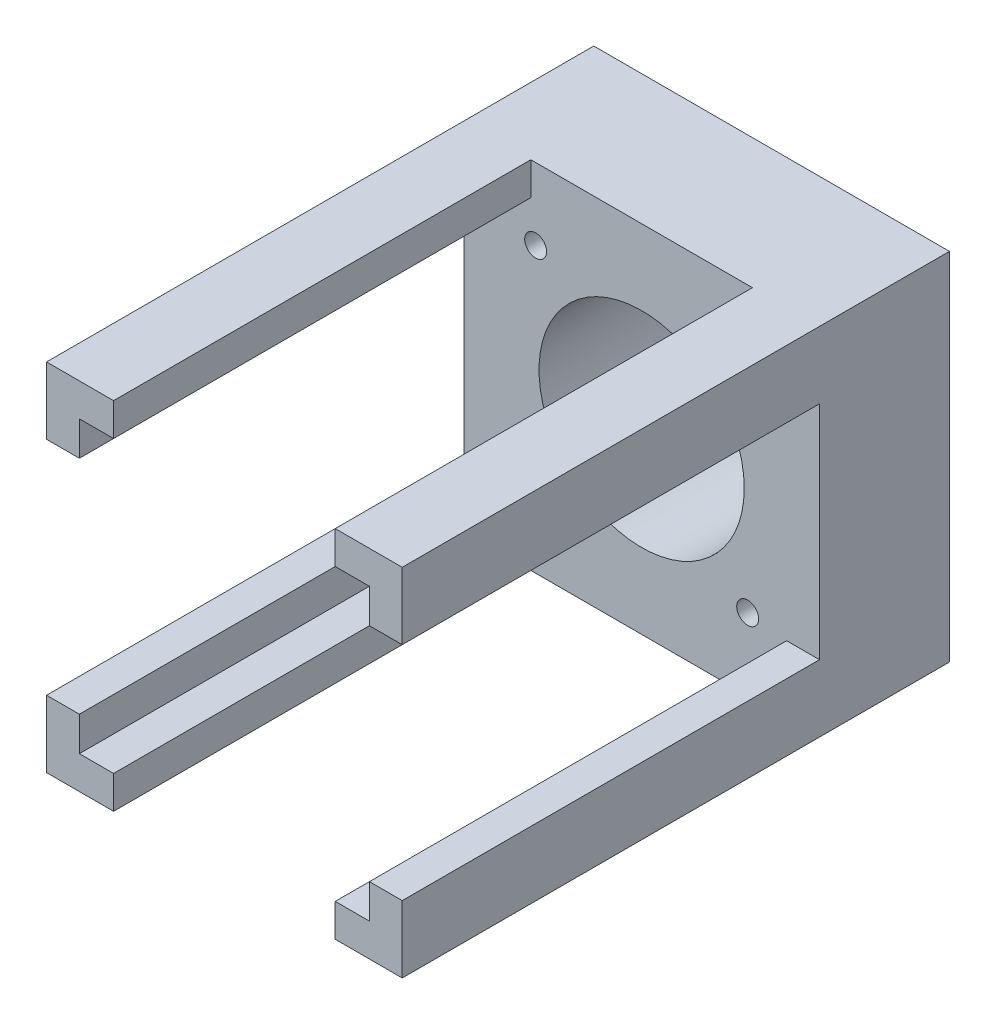
ISO-10303-21;
HEADER;
FILE_DESCRIPTION(('STEP AP214'),'2;1');
FILE_NAME('part.step','',(''),(''),'','','');
FILE_SCHEMA(('AUTOMOTIVE_DESIGN { 1 0 10303 214 1 1 1 1 }'));
ENDSEC;
DATA;
#1=APPLICATION_CONTEXT('core data for automotive mechanical design processes');
#2=APPLICATION_PROTOCOL_DEFINITION('international standard','automotive_design',2000,#1);
#3=PRODUCT_CONTEXT('',#1,'mechanical');
#4=PRODUCT('Part','Part','',(#3));
#5=PRODUCT_RELATED_PRODUCT_CATEGORY('part','',(#4));
#6=PRODUCT_DEFINITION_FORMATION('','',#4);
#7=PRODUCT_DEFINITION_CONTEXT('part definition',#1,'design');
#8=PRODUCT_DEFINITION('design','',#6,#7);
#9=PRODUCT_DEFINITION_SHAPE('','',#8);
#10=(LENGTH_UNIT() NAMED_UNIT(*) SI_UNIT(.MILLI.,.METRE.));
#11=(NAMED_UNIT(*) PLANE_ANGLE_UNIT() SI_UNIT($,.RADIAN.));
#12=(NAMED_UNIT(*) SI_UNIT($,.STERADIAN.) SOLID_ANGLE_UNIT());
#13=UNCERTAINTY_MEASURE_WITH_UNIT(LENGTH_MEASURE(1.E-05),#10,'distance_accuracy_value','');
#14=(GEOMETRIC_REPRESENTATION_CONTEXT(3) GLOBAL_UNCERTAINTY_ASSIGNED_CONTEXT((#13)) GLOBAL_UNIT_ASSIGNED_CONTEXT((#10,
#11,#12)) REPRESENTATION_CONTEXT('',''));
#15=CARTESIAN_POINT('',(0.,0.,0.));
#16=DIRECTION('',(0.,0.,1.));
#17=DIRECTION('',(1.,0.,0.));
#18=AXIS2_PLACEMENT_3D('',#15,#16,#17);
#19=CARTESIAN_POINT('',(0.,0.,80.));
#20=DIRECTION('',(0.,0.,-1.));
#21=DIRECTION('',(-1.,0.,0.));
#22=AXIS2_PLACEMENT_3D('',#19,#20,#21);
#23=PLANE('',#22);
#24=DIRECTION('',(0.,1.,0.));
#25=VECTOR('',#24,1.);
#26=CARTESIAN_POINT('',(3.65443037974685,0.,80.));
#27=LINE('',#26,#25);
#28=CARTESIAN_POINT('',(3.65443037974685,-32.6613924050633,80.));
#29=VERTEX_POINT('',#28);
#30=CARTESIAN_POINT('',(3.65443037974685,-27.8613924050633,80.));
#31=VERTEX_POINT('',#30);
#32=EDGE_CURVE('E338',#29,#31,#27,.T.);
#33=ORIENTED_EDGE('',*,*,#32,.T.);
#34=DIRECTION('',(1.,0.,0.));
#35=VECTOR('',#34,1.);
#36=CARTESIAN_POINT('',(0.,-27.8613924050633,80.));
#37=LINE('',#36,#35);
#38=CARTESIAN_POINT('',(-1.34556962025314,-27.8613924050633,80.));
#39=VERTEX_POINT('',#38);
#40=EDGE_CURVE('E335',#39,#31,#37,.T.);
#41=ORIENTED_EDGE('',*,*,#40,.F.);
#42=DIRECTION('',(0.,-1.,0.));
#43=VECTOR('',#42,1.);
#44=CARTESIAN_POINT('',(-1.34556962025311,0.,80.));
#45=LINE('',#44,#43);
#46=CARTESIAN_POINT('',(-1.34556962025314,-22.8613924050633,80.));
#47=VERTEX_POINT('',#46);
#48=EDGE_CURVE('E332',#47,#39,#45,.T.);
#49=ORIENTED_EDGE('',*,*,#48,.F.);
#50=DIRECTION('',(1.,0.,0.));
#51=VECTOR('',#50,1.);
#52=CARTESIAN_POINT('',(0.,-22.8613924050633,80.));
#53=LINE('',#52,#51);
#54=CARTESIAN_POINT('',(-6.14556962025314,-22.8613924050633,80.));
#55=VERTEX_POINT('',#54);
#56=EDGE_CURVE('E329',#55,#47,#53,.T.);
#57=ORIENTED_EDGE('',*,*,#56,.F.);
#58=DIRECTION('',(0.,-1.,0.));
#59=VECTOR('',#58,1.);
#60=CARTESIAN_POINT('',(-6.14556962025314,19.3386075949367,80.));
#61=LINE('',#60,#59);
#62=CARTESIAN_POINT('',(-6.14556962025314,-32.6613924050633,80.));
#63=VERTEX_POINT('',#62);
#64=EDGE_CURVE('E401',#55,#63,#61,.T.);
#65=ORIENTED_EDGE('',*,*,#64,.T.);
#66=DIRECTION('',(1.,0.,0.));
#67=VECTOR('',#66,1.);
#68=CARTESIAN_POINT('',(-6.14556962025314,-32.6613924050633,80.));
#69=LINE('',#68,#67);
#70=EDGE_CURVE('E405',#63,#29,#69,.T.);
#71=ORIENTED_EDGE('',*,*,#70,.T.);
#72=EDGE_LOOP('',(#33,#41,#49,#57,#65,#71));
#73=FACE_BOUND('',#72,.T.);
#74=ADVANCED_FACE('F42',(#73),#23,.F.);
#75=DIRECTION('',(1.,0.,0.));
#76=VECTOR('',#75,1.);
#77=CARTESIAN_POINT('',(0.,9.53860759493671,80.));
#78=LINE('',#77,#76);
#79=CARTESIAN_POINT('',(-6.14556962025314,9.53860759493671,80.));
#80=VERTEX_POINT('',#79);
#81=CARTESIAN_POINT('',(-1.34556962025314,9.53860759493671,80.));
#82=VERTEX_POINT('',#81);
#83=EDGE_CURVE('E326',#80,#82,#78,.T.);
#84=ORIENTED_EDGE('',*,*,#83,.T.);
#85=DIRECTION('',(0.,-1.,0.));
#86=VECTOR('',#85,1.);
#87=CARTESIAN_POINT('',(-1.34556962025314,0.,80.));
#88=LINE('',#87,#86);
#89=CARTESIAN_POINT('',(-1.34556962025314,14.5386075949367,80.));
#90=VERTEX_POINT('',#89);
#91=EDGE_CURVE('E323',#90,#82,#88,.T.);
#92=ORIENTED_EDGE('',*,*,#91,.F.);
#93=DIRECTION('',(1.,0.,0.));
#94=VECTOR('',#93,1.);
#95=CARTESIAN_POINT('',(0.,14.5386075949367,80.));
#96=LINE('',#95,#94);
#97=CARTESIAN_POINT('',(3.65443037974686,14.5386075949367,80.));
#98=VERTEX_POINT('',#97);
#99=EDGE_CURVE('E320',#90,#98,#96,.T.);
#100=ORIENTED_EDGE('',*,*,#99,.T.);
#101=DIRECTION('',(0.,-1.,0.));
#102=VECTOR('',#101,1.);
#103=CARTESIAN_POINT('',(3.65443037974686,0.,80.));
#104=LINE('',#103,#102);
#105=CARTESIAN_POINT('',(3.65443037974686,19.3386075949367,80.));
#106=VERTEX_POINT('',#105);
#107=EDGE_CURVE('E317',#106,#98,#104,.T.);
#108=ORIENTED_EDGE('',*,*,#107,.F.);
#109=DIRECTION('',(-1.,0.,0.));
#110=VECTOR('',#109,1.);
#111=CARTESIAN_POINT('',(-6.14556962025314,19.3386075949367,80.));
#112=LINE('',#111,#110);
#113=CARTESIAN_POINT('',(-6.14556962025314,19.3386075949367,80.));
#114=VERTEX_POINT('',#113);
#115=EDGE_CURVE('E96',#106,#114,#112,.T.);
#116=ORIENTED_EDGE('',*,*,#115,.T.);
#117=EDGE_CURVE('E402',#114,#80,#61,.T.);
#118=ORIENTED_EDGE('',*,*,#117,.T.);
#119=EDGE_LOOP('',(#84,#92,#100,#108,#116,#118));
#120=FACE_BOUND('',#119,.T.);
#121=ADVANCED_FACE('F512',(#120),#23,.F.);
#122=DIRECTION('',(0.,-1.,0.));
#123=VECTOR('',#122,1.);
#124=CARTESIAN_POINT('',(36.0544303797468,0.,80.));
#125=LINE('',#124,#123);
#126=CARTESIAN_POINT('',(36.0544303797468,19.3386075949367,80.));
#127=VERTEX_POINT('',#126);
#128=CARTESIAN_POINT('',(36.0544303797468,14.5386075949367,80.));
#129=VERTEX_POINT('',#128);
#130=EDGE_CURVE('E314',#127,#129,#125,.T.);
#131=ORIENTED_EDGE('',*,*,#130,.T.);
#132=DIRECTION('',(1.,0.,0.));
#133=VECTOR('',#132,1.);
#134=CARTESIAN_POINT('',(0.,14.5386075949367,80.));
#135=LINE('',#134,#133);
#136=CARTESIAN_POINT('',(41.0544303797469,14.5386075949367,80.));
#137=VERTEX_POINT('',#136);
#138=EDGE_CURVE('E311',#129,#137,#135,.T.);
#139=ORIENTED_EDGE('',*,*,#138,.T.);
#140=DIRECTION('',(0.,-1.,0.));
#141=VECTOR('',#140,1.);
#142=CARTESIAN_POINT('',(41.0544303797468,-1.70923402014245E-13,80.));
#143=LINE('',#142,#141);
#144=CARTESIAN_POINT('',(41.0544303797468,9.53860759493671,80.));
#145=VERTEX_POINT('',#144);
#146=EDGE_CURVE('E308',#137,#145,#143,.T.);
#147=ORIENTED_EDGE('',*,*,#146,.T.);
#148=DIRECTION('',(-1.,0.,0.));
#149=VECTOR('',#148,1.);
#150=CARTESIAN_POINT('',(0.,9.53860759493671,80.));
#151=LINE('',#150,#149);
#152=CARTESIAN_POINT('',(45.8544303797469,9.53860759493671,80.));
#153=VERTEX_POINT('',#152);
#154=EDGE_CURVE('E305',#153,#145,#151,.T.);
#155=ORIENTED_EDGE('',*,*,#154,.F.);
#156=DIRECTION('',(0.,1.,0.));
#157=VECTOR('',#156,1.);
#158=CARTESIAN_POINT('',(45.8544303797469,19.3386075949367,80.));
#159=LINE('',#158,#157);
#160=CARTESIAN_POINT('',(45.8544303797469,19.3386075949367,80.));
#161=VERTEX_POINT('',#160);
#162=EDGE_CURVE('E66',#153,#161,#159,.T.);
#163=ORIENTED_EDGE('',*,*,#162,.T.);
#164=EDGE_CURVE('E399',#161,#127,#112,.T.);
#165=ORIENTED_EDGE('',*,*,#164,.T.);
#166=EDGE_LOOP('',(#131,#139,#147,#155,#163,#165));
#167=FACE_BOUND('',#166,.T.);
#168=ADVANCED_FACE('F443',(#167),#23,.F.);
#169=CARTESIAN_POINT('',(19.8544303797469,-6.66139240506329,80.));
#170=DIRECTION('',(0.,0.,-1.));
#171=DIRECTION('',(-1.,0.,0.));
#172=AXIS2_PLACEMENT_3D('',#169,#170,#171);
#173=CYLINDRICAL_SURFACE('',#172,15.);
#174=CARTESIAN_POINT('',(19.8544303797469,-6.66139240506329,0.));
#175=DIRECTION('',(0.,0.,1.));
#176=DIRECTION('',(1.,0.,0.));
#177=AXIS2_PLACEMENT_3D('',#174,#175,#176);
#178=CIRCLE('',#177,15.);
#179=CARTESIAN_POINT('',(34.8544303797469,-6.66139240506329,0.));
#180=VERTEX_POINT('',#179);
#181=EDGE_CURVE('E395',#180,#180,#178,.T.);
#182=ORIENTED_EDGE('',*,*,#181,.F.);
#183=EDGE_LOOP('',(#182));
#184=FACE_BOUND('',#183,.T.);
#185=CARTESIAN_POINT('',(19.8544303797469,-6.66139240506329,19.));
#186=DIRECTION('',(0.,0.,1.));
#187=DIRECTION('',(1.,0.,0.));
#188=AXIS2_PLACEMENT_3D('',#185,#186,#187);
#189=CIRCLE('',#188,15.);
#190=CARTESIAN_POINT('',(34.8544303797469,-6.66139240506329,19.));
#191=VERTEX_POINT('',#190);
#192=EDGE_CURVE('E288',#191,#191,#189,.F.);
#193=ORIENTED_EDGE('',*,*,#192,.F.);
#194=EDGE_LOOP('',(#193));
#195=FACE_BOUND('',#194,.T.);
#196=ADVANCED_FACE('F531',(#184,#195),#173,.F.);
#197=CARTESIAN_POINT('',(35.3544303797469,8.83860759493671,80.));
#198=DIRECTION('',(0.,0.,-1.));
#199=DIRECTION('',(-1.,0.,0.));
#200=AXIS2_PLACEMENT_3D('',#197,#198,#199);
#201=CYLINDRICAL_SURFACE('',#200,1.6);
#202=CARTESIAN_POINT('',(35.3544303797469,8.83860759493671,0.));
#203=DIRECTION('',(0.,0.,1.));
#204=DIRECTION('',(1.,0.,0.));
#205=AXIS2_PLACEMENT_3D('',#202,#203,#204);
#206=CIRCLE('',#205,1.6);
#207=CARTESIAN_POINT('',(36.9544303797469,8.83860759493671,0.));
#208=VERTEX_POINT('',#207);
#209=EDGE_CURVE('E392',#208,#208,#206,.T.);
#210=ORIENTED_EDGE('',*,*,#209,.F.);
#211=EDGE_LOOP('',(#210));
#212=FACE_BOUND('',#211,.T.);
#213=CARTESIAN_POINT('',(35.3544303797469,8.83860759493671,19.));
#214=DIRECTION('',(0.,0.,1.));
#215=DIRECTION('',(1.,0.,0.));
#216=AXIS2_PLACEMENT_3D('',#213,#214,#215);
#217=CIRCLE('',#216,1.6);
#218=CARTESIAN_POINT('',(36.9544303797469,8.83860759493671,19.));
#219=VERTEX_POINT('',#218);
#220=EDGE_CURVE('E231',#219,#219,#217,.F.);
#221=ORIENTED_EDGE('',*,*,#220,.F.);
#222=EDGE_LOOP('',(#221));
#223=FACE_BOUND('',#222,.T.);
#224=ADVANCED_FACE('F535',(#212,#223),#201,.F.);
#225=CARTESIAN_POINT('',(35.3544303797469,-22.1613924050633,80.));
#226=DIRECTION('',(0.,0.,-1.));
#227=DIRECTION('',(-1.,0.,0.));
#228=AXIS2_PLACEMENT_3D('',#225,#226,#227);
#229=CYLINDRICAL_SURFACE('',#228,1.6);
#230=CARTESIAN_POINT('',(35.3544303797469,-22.1613924050633,0.));
#231=DIRECTION('',(0.,0.,1.));
#232=DIRECTION('',(1.,0.,0.));
#233=AXIS2_PLACEMENT_3D('',#230,#231,#232);
#234=CIRCLE('',#233,1.6);
#235=CARTESIAN_POINT('',(36.9544303797469,-22.1613924050633,0.));
#236=VERTEX_POINT('',#235);
#237=EDGE_CURVE('E389',#236,#236,#234,.T.);
#238=ORIENTED_EDGE('',*,*,#237,.F.);
#239=EDGE_LOOP('',(#238));
#240=FACE_BOUND('',#239,.T.);
#241=CARTESIAN_POINT('',(35.3544303797469,-22.1613924050633,19.));
#242=DIRECTION('',(0.,0.,1.));
#243=DIRECTION('',(1.,0.,0.));
#244=AXIS2_PLACEMENT_3D('',#241,#242,#243);
#245=CIRCLE('',#244,1.6);
#246=CARTESIAN_POINT('',(36.9544303797469,-22.1613924050633,19.));
#247=VERTEX_POINT('',#246);
#248=EDGE_CURVE('E291',#247,#247,#245,.F.);
#249=ORIENTED_EDGE('',*,*,#248,.F.);
#250=EDGE_LOOP('',(#249));
#251=FACE_BOUND('',#250,.T.);
#252=ADVANCED_FACE('F540',(#240,#251),#229,.F.);
#253=CARTESIAN_POINT('',(4.35443037974686,-22.1613924050633,80.));
#254=DIRECTION('',(0.,0.,-1.));
#255=DIRECTION('',(-1.,0.,0.));
#256=AXIS2_PLACEMENT_3D('',#253,#254,#255);
#257=CYLINDRICAL_SURFACE('',#256,1.6);
#258=CARTESIAN_POINT('',(4.35443037974686,-22.1613924050633,0.));
#259=DIRECTION('',(0.,0.,1.));
#260=DIRECTION('',(1.,0.,0.));
#261=AXIS2_PLACEMENT_3D('',#258,#259,#260);
#262=CIRCLE('',#261,1.6);
#263=CARTESIAN_POINT('',(5.95443037974686,-22.1613924050633,0.));
#264=VERTEX_POINT('',#263);
#265=EDGE_CURVE('E386',#264,#264,#262,.T.);
#266=ORIENTED_EDGE('',*,*,#265,.F.);
#267=EDGE_LOOP('',(#266));
#268=FACE_BOUND('',#267,.T.);
#269=CARTESIAN_POINT('',(4.35443037974686,-22.1613924050633,19.));
#270=DIRECTION('',(0.,0.,1.));
#271=DIRECTION('',(1.,0.,0.));
#272=AXIS2_PLACEMENT_3D('',#269,#270,#271);
#273=CIRCLE('',#272,1.6);
#274=CARTESIAN_POINT('',(5.95443037974686,-22.1613924050633,19.));
#275=VERTEX_POINT('',#274);
#276=EDGE_CURVE('E297',#275,#275,#273,.F.);
#277=ORIENTED_EDGE('',*,*,#276,.F.);
#278=EDGE_LOOP('',(#277));
#279=FACE_BOUND('',#278,.T.);
#280=ADVANCED_FACE('F527',(#268,#279),#257,.F.);
#281=CARTESIAN_POINT('',(4.35443037974686,8.83860759493671,80.));
#282=DIRECTION('',(0.,0.,-1.));
#283=DIRECTION('',(-1.,0.,0.));
#284=AXIS2_PLACEMENT_3D('',#281,#282,#283);
#285=CYLINDRICAL_SURFACE('',#284,1.6);
#286=CARTESIAN_POINT('',(4.35443037974686,8.83860759493671,0.));
#287=DIRECTION('',(0.,0.,1.));
#288=DIRECTION('',(1.,0.,0.));
#289=AXIS2_PLACEMENT_3D('',#286,#287,#288);
#290=CIRCLE('',#289,1.6);
#291=CARTESIAN_POINT('',(5.95443037974686,8.83860759493671,0.));
#292=VERTEX_POINT('',#291);
#293=EDGE_CURVE('E345',#292,#292,#290,.T.);
#294=ORIENTED_EDGE('',*,*,#293,.F.);
#295=EDGE_LOOP('',(#294));
#296=FACE_BOUND('',#295,.T.);
#297=CARTESIAN_POINT('',(4.35443037974686,8.83860759493671,19.));
#298=DIRECTION('',(0.,0.,1.));
#299=DIRECTION('',(1.,0.,0.));
#300=AXIS2_PLACEMENT_3D('',#297,#298,#299);
#301=CIRCLE('',#300,1.6);
#302=CARTESIAN_POINT('',(5.95443037974686,8.83860759493671,19.));
#303=VERTEX_POINT('',#302);
#304=EDGE_CURVE('E294',#303,#303,#301,.F.);
#305=ORIENTED_EDGE('',*,*,#304,.F.);
#306=EDGE_LOOP('',(#305));
#307=FACE_BOUND('',#306,.T.);
#308=ADVANCED_FACE('F521',(#296,#307),#285,.F.);
#309=DIRECTION('',(1.,0.,0.));
#310=VECTOR('',#309,1.);
#311=CARTESIAN_POINT('',(0.,-27.8613924050633,80.));
#312=LINE('',#311,#310);
#313=CARTESIAN_POINT('',(36.0544303797468,-27.8613924050633,80.));
#314=VERTEX_POINT('',#313);
#315=CARTESIAN_POINT('',(41.0544303797469,-27.8613924050633,80.));
#316=VERTEX_POINT('',#315);
#317=EDGE_CURVE('E239',#314,#316,#312,.T.);
#318=ORIENTED_EDGE('',*,*,#317,.F.);
#319=DIRECTION('',(0.,1.,0.));
#320=VECTOR('',#319,1.);
#321=CARTESIAN_POINT('',(36.0544303797468,0.,80.));
#322=LINE('',#321,#320);
#323=CARTESIAN_POINT('',(36.0544303797468,-32.6613924050633,80.));
#324=VERTEX_POINT('',#323);
#325=EDGE_CURVE('E242',#324,#314,#322,.T.);
#326=ORIENTED_EDGE('',*,*,#325,.F.);
#327=CARTESIAN_POINT('',(45.8544303797469,-32.6613924050633,80.));
#328=VERTEX_POINT('',#327);
#329=EDGE_CURVE('E404',#324,#328,#69,.T.);
#330=ORIENTED_EDGE('',*,*,#329,.T.);
#331=CARTESIAN_POINT('',(45.8544303797469,-22.8613924050633,80.));
#332=VERTEX_POINT('',#331);
#333=EDGE_CURVE('E408',#328,#332,#159,.T.);
#334=ORIENTED_EDGE('',*,*,#333,.T.);
#335=DIRECTION('',(-1.,0.,0.));
#336=VECTOR('',#335,1.);
#337=CARTESIAN_POINT('',(0.,-22.8613924050633,80.));
#338=LINE('',#337,#336);
#339=CARTESIAN_POINT('',(41.0544303797468,-22.8613924050633,80.));
#340=VERTEX_POINT('',#339);
#341=EDGE_CURVE('E303',#332,#340,#338,.T.);
#342=ORIENTED_EDGE('',*,*,#341,.T.);
#343=DIRECTION('',(0.,-1.,0.));
#344=VECTOR('',#343,1.);
#345=CARTESIAN_POINT('',(41.0544303797467,1.70923402014245E-13,80.));
#346=LINE('',#345,#344);
#347=EDGE_CURVE('E229',#340,#316,#346,.T.);
#348=ORIENTED_EDGE('',*,*,#347,.T.);
#349=EDGE_LOOP('',(#318,#326,#330,#334,#342,#348));
#350=FACE_BOUND('',#349,.T.);
#351=ADVANCED_FACE('F500',(#350),#23,.F.);
#352=CARTESIAN_POINT('',(0.,0.,0.));
#353=DIRECTION('',(0.,0.,-1.));
#354=DIRECTION('',(-1.,0.,0.));
#355=AXIS2_PLACEMENT_3D('',#352,#353,#354);
#356=PLANE('',#355);
#357=ORIENTED_EDGE('',*,*,#265,.T.);
#358=EDGE_LOOP('',(#357));
#359=FACE_BOUND('',#358,.T.);
#360=ORIENTED_EDGE('',*,*,#209,.T.);
#361=EDGE_LOOP('',(#360));
#362=FACE_BOUND('',#361,.T.);
#363=DIRECTION('',(-1.,0.,0.));
#364=VECTOR('',#363,1.);
#365=CARTESIAN_POINT('',(-6.14556962025314,19.3386075949367,0.));
#366=LINE('',#365,#364);
#367=CARTESIAN_POINT('',(45.8544303797469,19.3386075949367,0.));
#368=VERTEX_POINT('',#367);
#369=CARTESIAN_POINT('',(-6.14556962025314,19.3386075949367,0.));
#370=VERTEX_POINT('',#369);
#371=EDGE_CURVE('E398',#368,#370,#366,.T.);
#372=ORIENTED_EDGE('',*,*,#371,.F.);
#373=DIRECTION('',(0.,1.,0.));
#374=VECTOR('',#373,1.);
#375=CARTESIAN_POINT('',(45.8544303797469,19.3386075949367,0.));
#376=LINE('',#375,#374);
#377=CARTESIAN_POINT('',(45.8544303797469,-32.6613924050633,0.));
#378=VERTEX_POINT('',#377);
#379=EDGE_CURVE('E88',#378,#368,#376,.T.);
#380=ORIENTED_EDGE('',*,*,#379,.F.);
#381=DIRECTION('',(1.,0.,0.));
#382=VECTOR('',#381,1.);
#383=CARTESIAN_POINT('',(-6.14556962025314,-32.6613924050633,0.));
#384=LINE('',#383,#382);
#385=CARTESIAN_POINT('',(-6.14556962025314,-32.6613924050633,0.));
#386=VERTEX_POINT('',#385);
#387=EDGE_CURVE('E416',#386,#378,#384,.T.);
#388=ORIENTED_EDGE('',*,*,#387,.F.);
#389=DIRECTION('',(0.,-1.,0.));
#390=VECTOR('',#389,1.);
#391=CARTESIAN_POINT('',(-6.14556962025314,19.3386075949367,0.));
#392=LINE('',#391,#390);
#393=EDGE_CURVE('E414',#370,#386,#392,.T.);
#394=ORIENTED_EDGE('',*,*,#393,.F.);
#395=EDGE_LOOP('',(#372,#380,#388,#394));
#396=FACE_BOUND('',#395,.T.);
#397=ORIENTED_EDGE('',*,*,#181,.T.);
#398=EDGE_LOOP('',(#397));
#399=FACE_BOUND('',#398,.T.);
#400=ORIENTED_EDGE('',*,*,#237,.T.);
#401=EDGE_LOOP('',(#400));
#402=FACE_BOUND('',#401,.T.);
#403=ORIENTED_EDGE('',*,*,#293,.T.);
#404=EDGE_LOOP('',(#403));
#405=FACE_BOUND('',#404,.T.);
#406=ADVANCED_FACE('F433',(#359,#362,#396,#399,#402,#405),#356,.T.);
#407=CARTESIAN_POINT('',(-6.14556962025314,19.3386075949367,80.));
#408=DIRECTION('',(0.,-1.,0.));
#409=DIRECTION('',(0.,0.,-1.));
#410=AXIS2_PLACEMENT_3D('',#407,#408,#409);
#411=PLANE('',#410);
#412=ORIENTED_EDGE('',*,*,#115,.F.);
#413=DIRECTION('',(0.,0.,1.));
#414=VECTOR('',#413,1.);
#415=CARTESIAN_POINT('',(3.65443037974686,19.3386075949367,19.));
#416=LINE('',#415,#414);
#417=CARTESIAN_POINT('',(3.65443037974686,19.3386075949367,19.));
#418=VERTEX_POINT('',#417);
#419=EDGE_CURVE('E370',#418,#106,#416,.T.);
#420=ORIENTED_EDGE('',*,*,#419,.F.);
#421=DIRECTION('',(-1.,0.,0.));
#422=VECTOR('',#421,1.);
#423=CARTESIAN_POINT('',(0.,19.3386075949367,19.));
#424=LINE('',#423,#422);
#425=CARTESIAN_POINT('',(36.0544303797468,19.3386075949367,19.));
#426=VERTEX_POINT('',#425);
#427=EDGE_CURVE('E255',#426,#418,#424,.T.);
#428=ORIENTED_EDGE('',*,*,#427,.F.);
#429=DIRECTION('',(0.,0.,1.));
#430=VECTOR('',#429,1.);
#431=CARTESIAN_POINT('',(36.0544303797468,19.3386075949367,19.));
#432=LINE('',#431,#430);
#433=EDGE_CURVE('E372',#426,#127,#432,.T.);
#434=ORIENTED_EDGE('',*,*,#433,.T.);
#435=ORIENTED_EDGE('',*,*,#164,.F.);
#436=DIRECTION('',(0.,0.,-1.));
#437=VECTOR('',#436,1.);
#438=CARTESIAN_POINT('',(45.8544303797469,19.3386075949367,80.));
#439=LINE('',#438,#437);
#440=EDGE_CURVE('E411',#161,#368,#439,.T.);
#441=ORIENTED_EDGE('',*,*,#440,.T.);
#442=ORIENTED_EDGE('',*,*,#371,.T.);
#443=DIRECTION('',(0.,0.,-1.));
#444=VECTOR('',#443,1.);
#445=CARTESIAN_POINT('',(-6.14556962025314,19.3386075949367,80.));
#446=LINE('',#445,#444);
#447=EDGE_CURVE('E11',#114,#370,#446,.T.);
#448=ORIENTED_EDGE('',*,*,#447,.F.);
#449=EDGE_LOOP('',(#412,#420,#428,#434,#435,#441,#442,#448));
#450=FACE_BOUND('',#449,.T.);
#451=ADVANCED_FACE('F44',(#450),#411,.F.);
#452=CARTESIAN_POINT('',(-6.14556962025314,19.3386075949367,80.));
#453=DIRECTION('',(1.,0.,0.));
#454=DIRECTION('',(0.,0.,-1.));
#455=AXIS2_PLACEMENT_3D('',#452,#453,#454);
#456=PLANE('',#455);
#457=ORIENTED_EDGE('',*,*,#64,.F.);
#458=DIRECTION('',(0.,0.,1.));
#459=VECTOR('',#458,1.);
#460=CARTESIAN_POINT('',(-6.14556962025314,-22.8613924050633,19.));
#461=LINE('',#460,#459);
#462=CARTESIAN_POINT('',(-6.14556962025314,-22.8613924050633,19.));
#463=VERTEX_POINT('',#462);
#464=EDGE_CURVE('E359',#463,#55,#461,.T.);
#465=ORIENTED_EDGE('',*,*,#464,.F.);
#466=DIRECTION('',(0.,-1.,0.));
#467=VECTOR('',#466,1.);
#468=CARTESIAN_POINT('',(-6.14556962025314,0.,19.));
#469=LINE('',#468,#467);
#470=CARTESIAN_POINT('',(-6.14556962025314,9.53860759493671,19.));
#471=VERTEX_POINT('',#470);
#472=EDGE_CURVE('E268',#471,#463,#469,.T.);
#473=ORIENTED_EDGE('',*,*,#472,.F.);
#474=DIRECTION('',(0.,0.,1.));
#475=VECTOR('',#474,1.);
#476=CARTESIAN_POINT('',(-6.14556962025314,9.53860759493671,19.));
#477=LINE('',#476,#475);
#478=EDGE_CURVE('E361',#471,#80,#477,.T.);
#479=ORIENTED_EDGE('',*,*,#478,.T.);
#480=ORIENTED_EDGE('',*,*,#117,.F.);
#481=ORIENTED_EDGE('',*,*,#447,.T.);
#482=ORIENTED_EDGE('',*,*,#393,.T.);
#483=DIRECTION('',(0.,0.,-1.));
#484=VECTOR('',#483,1.);
#485=CARTESIAN_POINT('',(-6.14556962025314,-32.6613924050633,80.));
#486=LINE('',#485,#484);
#487=EDGE_CURVE('E50',#63,#386,#486,.T.);
#488=ORIENTED_EDGE('',*,*,#487,.F.);
#489=EDGE_LOOP('',(#457,#465,#473,#479,#480,#481,#482,#488));
#490=FACE_BOUND('',#489,.T.);
#491=ADVANCED_FACE('F475',(#490),#456,.F.);
#492=CARTESIAN_POINT('',(-6.14556962025314,-32.6613924050633,80.));
#493=DIRECTION('',(0.,1.,0.));
#494=DIRECTION('',(0.,0.,1.));
#495=AXIS2_PLACEMENT_3D('',#492,#493,#494);
#496=PLANE('',#495);
#497=ORIENTED_EDGE('',*,*,#329,.F.);
#498=DIRECTION('',(0.,0.,1.));
#499=VECTOR('',#498,1.);
#500=CARTESIAN_POINT('',(36.0544303797468,-32.6613924050633,19.));
#501=LINE('',#500,#499);
#502=CARTESIAN_POINT('',(36.0544303797468,-32.6613924050633,19.));
#503=VERTEX_POINT('',#502);
#504=EDGE_CURVE('E348',#503,#324,#501,.T.);
#505=ORIENTED_EDGE('',*,*,#504,.F.);
#506=DIRECTION('',(1.,0.,0.));
#507=VECTOR('',#506,1.);
#508=CARTESIAN_POINT('',(0.,-32.6613924050633,19.));
#509=LINE('',#508,#507);
#510=CARTESIAN_POINT('',(3.65443037974685,-32.6613924050633,19.));
#511=VERTEX_POINT('',#510);
#512=EDGE_CURVE('E282',#511,#503,#509,.T.);
#513=ORIENTED_EDGE('',*,*,#512,.F.);
#514=DIRECTION('',(0.,0.,1.));
#515=VECTOR('',#514,1.);
#516=CARTESIAN_POINT('',(3.65443037974685,-32.6613924050633,19.));
#517=LINE('',#516,#515);
#518=EDGE_CURVE('E350',#511,#29,#517,.T.);
#519=ORIENTED_EDGE('',*,*,#518,.T.);
#520=ORIENTED_EDGE('',*,*,#70,.F.);
#521=ORIENTED_EDGE('',*,*,#487,.T.);
#522=ORIENTED_EDGE('',*,*,#387,.T.);
#523=DIRECTION('',(0.,0.,-1.));
#524=VECTOR('',#523,1.);
#525=CARTESIAN_POINT('',(45.8544303797469,-32.6613924050633,80.));
#526=LINE('',#525,#524);
#527=EDGE_CURVE('E420',#328,#378,#526,.T.);
#528=ORIENTED_EDGE('',*,*,#527,.F.);
#529=EDGE_LOOP('',(#497,#505,#513,#519,#520,#521,#522,#528));
#530=FACE_BOUND('',#529,.T.);
#531=ADVANCED_FACE('F427',(#530),#496,.F.);
#532=CARTESIAN_POINT('',(45.8544303797469,19.3386075949367,80.));
#533=DIRECTION('',(-1.,0.,0.));
#534=DIRECTION('',(0.,-1.,0.));
#535=AXIS2_PLACEMENT_3D('',#532,#533,#534);
#536=PLANE('',#535);
#537=ORIENTED_EDGE('',*,*,#162,.F.);
#538=DIRECTION('',(0.,0.,1.));
#539=VECTOR('',#538,1.);
#540=CARTESIAN_POINT('',(45.8544303797469,9.53860759493671,19.));
#541=LINE('',#540,#539);
#542=CARTESIAN_POINT('',(45.8544303797469,9.53860759493671,19.));
#543=VERTEX_POINT('',#542);
#544=EDGE_CURVE('E381',#543,#153,#541,.T.);
#545=ORIENTED_EDGE('',*,*,#544,.F.);
#546=DIRECTION('',(0.,1.,0.));
#547=VECTOR('',#546,1.);
#548=CARTESIAN_POINT('',(45.8544303797469,0.,19.));
#549=LINE('',#548,#547);
#550=CARTESIAN_POINT('',(45.8544303797469,-22.8613924050633,19.));
#551=VERTEX_POINT('',#550);
#552=EDGE_CURVE('E222',#551,#543,#549,.T.);
#553=ORIENTED_EDGE('',*,*,#552,.F.);
#554=DIRECTION('',(0.,0.,1.));
#555=VECTOR('',#554,1.);
#556=CARTESIAN_POINT('',(45.8544303797469,-22.8613924050633,19.));
#557=LINE('',#556,#555);
#558=EDGE_CURVE('E220',#551,#332,#557,.T.);
#559=ORIENTED_EDGE('',*,*,#558,.T.);
#560=ORIENTED_EDGE('',*,*,#333,.F.);
#561=ORIENTED_EDGE('',*,*,#527,.T.);
#562=ORIENTED_EDGE('',*,*,#379,.T.);
#563=ORIENTED_EDGE('',*,*,#440,.F.);
#564=EDGE_LOOP('',(#537,#545,#553,#559,#560,#561,#562,#563));
#565=FACE_BOUND('',#564,.T.);
#566=ADVANCED_FACE('F438',(#565),#536,.F.);
#567=CARTESIAN_POINT('',(41.0544303797467,1.70923402014245E-13,19.));
#568=DIRECTION('',(-1.,0.,0.));
#569=DIRECTION('',(0.,-1.,0.));
#570=AXIS2_PLACEMENT_3D('',#567,#568,#569);
#571=PLANE('',#570);
#572=ORIENTED_EDGE('',*,*,#347,.F.);
#573=DIRECTION('',(0.,0.,1.));
#574=VECTOR('',#573,1.);
#575=CARTESIAN_POINT('',(41.0544303797468,-22.8613924050633,19.));
#576=LINE('',#575,#574);
#577=CARTESIAN_POINT('',(41.0544303797468,-22.8613924050633,19.));
#578=VERTEX_POINT('',#577);
#579=EDGE_CURVE('E217',#578,#340,#576,.T.);
#580=ORIENTED_EDGE('',*,*,#579,.F.);
#581=DIRECTION('',(0.,-1.,0.));
#582=VECTOR('',#581,1.);
#583=CARTESIAN_POINT('',(41.0544303797467,1.70923402014245E-13,19.));
#584=LINE('',#583,#582);
#585=CARTESIAN_POINT('',(41.0544303797469,-27.8613924050633,19.));
#586=VERTEX_POINT('',#585);
#587=EDGE_CURVE('E223',#578,#586,#584,.T.);
#588=ORIENTED_EDGE('',*,*,#587,.T.);
#589=DIRECTION('',(0.,0.,1.));
#590=VECTOR('',#589,1.);
#591=CARTESIAN_POINT('',(41.0544303797469,-27.8613924050633,19.));
#592=LINE('',#591,#590);
#593=EDGE_CURVE('E343',#586,#316,#592,.T.);
#594=ORIENTED_EDGE('',*,*,#593,.T.);
#595=EDGE_LOOP('',(#572,#580,#588,#594));
#596=FACE_BOUND('',#595,.T.);
#597=ADVANCED_FACE('F226',(#596),#571,.T.);
#598=CARTESIAN_POINT('',(0.,-27.8613924050633,19.));
#599=DIRECTION('',(0.,-1.,0.));
#600=DIRECTION('',(0.,0.,-1.));
#601=AXIS2_PLACEMENT_3D('',#598,#599,#600);
#602=PLANE('',#601);
#603=ORIENTED_EDGE('',*,*,#317,.T.);
#604=ORIENTED_EDGE('',*,*,#593,.F.);
#605=DIRECTION('',(1.,0.,0.));
#606=VECTOR('',#605,1.);
#607=CARTESIAN_POINT('',(0.,-27.8613924050633,19.));
#608=LINE('',#607,#606);
#609=CARTESIAN_POINT('',(36.0544303797468,-27.8613924050633,19.));
#610=VERTEX_POINT('',#609);
#611=EDGE_CURVE('E238',#610,#586,#608,.T.);
#612=ORIENTED_EDGE('',*,*,#611,.F.);
#613=DIRECTION('',(0.,0.,1.));
#614=VECTOR('',#613,1.);
#615=CARTESIAN_POINT('',(36.0544303797468,-27.8613924050633,19.));
#616=LINE('',#615,#614);
#617=EDGE_CURVE('E346',#610,#314,#616,.T.);
#618=ORIENTED_EDGE('',*,*,#617,.T.);
#619=EDGE_LOOP('',(#603,#604,#612,#618));
#620=FACE_BOUND('',#619,.T.);
#621=ADVANCED_FACE('F496',(#620),#602,.F.);
#622=CARTESIAN_POINT('',(36.0544303797468,0.,19.));
#623=DIRECTION('',(1.,0.,0.));
#624=DIRECTION('',(0.,0.,-1.));
#625=AXIS2_PLACEMENT_3D('',#622,#623,#624);
#626=PLANE('',#625);
#627=ORIENTED_EDGE('',*,*,#325,.T.);
#628=ORIENTED_EDGE('',*,*,#617,.F.);
#629=DIRECTION('',(0.,1.,0.));
#630=VECTOR('',#629,1.);
#631=CARTESIAN_POINT('',(36.0544303797468,0.,19.));
#632=LINE('',#631,#630);
#633=EDGE_CURVE('E285',#503,#610,#632,.T.);
#634=ORIENTED_EDGE('',*,*,#633,.F.);
#635=ORIENTED_EDGE('',*,*,#504,.T.);
#636=EDGE_LOOP('',(#627,#628,#634,#635));
#637=FACE_BOUND('',#636,.T.);
#638=ADVANCED_FACE('F502',(#637),#626,.F.);
#639=CARTESIAN_POINT('',(3.65443037974685,0.,19.));
#640=DIRECTION('',(1.,0.,0.));
#641=DIRECTION('',(0.,1.,0.));
#642=AXIS2_PLACEMENT_3D('',#639,#640,#641);
#643=PLANE('',#642);
#644=ORIENTED_EDGE('',*,*,#32,.F.);
#645=ORIENTED_EDGE('',*,*,#518,.F.);
#646=DIRECTION('',(0.,1.,0.));
#647=VECTOR('',#646,1.);
#648=CARTESIAN_POINT('',(3.65443037974685,0.,19.));
#649=LINE('',#648,#647);
#650=CARTESIAN_POINT('',(3.65443037974685,-27.8613924050633,19.));
#651=VERTEX_POINT('',#650);
#652=EDGE_CURVE('E280',#511,#651,#649,.T.);
#653=ORIENTED_EDGE('',*,*,#652,.T.);
#654=DIRECTION('',(0.,0.,1.));
#655=VECTOR('',#654,1.);
#656=CARTESIAN_POINT('',(3.65443037974685,-27.8613924050633,19.));
#657=LINE('',#656,#655);
#658=EDGE_CURVE('E353',#651,#31,#657,.T.);
#659=ORIENTED_EDGE('',*,*,#658,.T.);
#660=EDGE_LOOP('',(#644,#645,#653,#659));
#661=FACE_BOUND('',#660,.T.);
#662=ADVANCED_FACE('F492',(#661),#643,.T.);
#663=CARTESIAN_POINT('',(0.,-27.8613924050633,19.));
#664=DIRECTION('',(0.,-1.,0.));
#665=DIRECTION('',(0.,0.,-1.));
#666=AXIS2_PLACEMENT_3D('',#663,#664,#665);
#667=PLANE('',#666);
#668=ORIENTED_EDGE('',*,*,#40,.T.);
#669=ORIENTED_EDGE('',*,*,#658,.F.);
#670=DIRECTION('',(1.,0.,0.));
#671=VECTOR('',#670,1.);
#672=CARTESIAN_POINT('',(0.,-27.8613924050633,19.));
#673=LINE('',#672,#671);
#674=CARTESIAN_POINT('',(-1.34556962025314,-27.8613924050633,19.));
#675=VERTEX_POINT('',#674);
#676=EDGE_CURVE('E277',#675,#651,#673,.T.);
#677=ORIENTED_EDGE('',*,*,#676,.F.);
#678=DIRECTION('',(0.,0.,1.));
#679=VECTOR('',#678,1.);
#680=CARTESIAN_POINT('',(-1.34556962025314,-27.8613924050633,19.));
#681=LINE('',#680,#679);
#682=EDGE_CURVE('E355',#675,#39,#681,.T.);
#683=ORIENTED_EDGE('',*,*,#682,.T.);
#684=EDGE_LOOP('',(#668,#669,#677,#683));
#685=FACE_BOUND('',#684,.T.);
#686=ADVANCED_FACE('F490',(#685),#667,.F.);
#687=CARTESIAN_POINT('',(-1.34556962025311,0.,19.));
#688=DIRECTION('',(-1.,0.,0.));
#689=DIRECTION('',(0.,-1.,0.));
#690=AXIS2_PLACEMENT_3D('',#687,#688,#689);
#691=PLANE('',#690);
#692=ORIENTED_EDGE('',*,*,#48,.T.);
#693=ORIENTED_EDGE('',*,*,#682,.F.);
#694=DIRECTION('',(0.,-1.,0.));
#695=VECTOR('',#694,1.);
#696=CARTESIAN_POINT('',(-1.34556962025311,0.,19.));
#697=LINE('',#696,#695);
#698=CARTESIAN_POINT('',(-1.34556962025314,-22.8613924050633,19.));
#699=VERTEX_POINT('',#698);
#700=EDGE_CURVE('E274',#699,#675,#697,.T.);
#701=ORIENTED_EDGE('',*,*,#700,.F.);
#702=DIRECTION('',(0.,0.,1.));
#703=VECTOR('',#702,1.);
#704=CARTESIAN_POINT('',(-1.34556962025314,-22.8613924050633,19.));
#705=LINE('',#704,#703);
#706=EDGE_CURVE('E357',#699,#47,#705,.T.);
#707=ORIENTED_EDGE('',*,*,#706,.T.);
#708=EDGE_LOOP('',(#692,#693,#701,#707));
#709=FACE_BOUND('',#708,.T.);
#710=ADVANCED_FACE('F483',(#709),#691,.F.);
#711=CARTESIAN_POINT('',(0.,-22.8613924050633,19.));
#712=DIRECTION('',(0.,-1.,0.));
#713=DIRECTION('',(0.,0.,-1.));
#714=AXIS2_PLACEMENT_3D('',#711,#712,#713);
#715=PLANE('',#714);
#716=ORIENTED_EDGE('',*,*,#56,.T.);
#717=ORIENTED_EDGE('',*,*,#706,.F.);
#718=DIRECTION('',(1.,0.,0.));
#719=VECTOR('',#718,1.);
#720=CARTESIAN_POINT('',(0.,-22.8613924050633,19.));
#721=LINE('',#720,#719);
#722=EDGE_CURVE('E271',#463,#699,#721,.T.);
#723=ORIENTED_EDGE('',*,*,#722,.F.);
#724=ORIENTED_EDGE('',*,*,#464,.T.);
#725=EDGE_LOOP('',(#716,#717,#723,#724));
#726=FACE_BOUND('',#725,.T.);
#727=ADVANCED_FACE('F478',(#726),#715,.F.);
#728=CARTESIAN_POINT('',(0.,9.53860759493671,19.));
#729=DIRECTION('',(0.,-1.,0.));
#730=DIRECTION('',(0.,0.,-1.));
#731=AXIS2_PLACEMENT_3D('',#728,#729,#730);
#732=PLANE('',#731);
#733=ORIENTED_EDGE('',*,*,#83,.F.);
#734=ORIENTED_EDGE('',*,*,#478,.F.);
#735=DIRECTION('',(1.,0.,0.));
#736=VECTOR('',#735,1.);
#737=CARTESIAN_POINT('',(0.,9.53860759493671,19.));
#738=LINE('',#737,#736);
#739=CARTESIAN_POINT('',(-1.34556962025314,9.53860759493671,19.));
#740=VERTEX_POINT('',#739);
#741=EDGE_CURVE('E266',#471,#740,#738,.T.);
#742=ORIENTED_EDGE('',*,*,#741,.T.);
#743=DIRECTION('',(0.,0.,1.));
#744=VECTOR('',#743,1.);
#745=CARTESIAN_POINT('',(-1.34556962025314,9.53860759493671,19.));
#746=LINE('',#745,#744);
#747=EDGE_CURVE('E364',#740,#82,#746,.T.);
#748=ORIENTED_EDGE('',*,*,#747,.T.);
#749=EDGE_LOOP('',(#733,#734,#742,#748));
#750=FACE_BOUND('',#749,.T.);
#751=ADVANCED_FACE('F570',(#750),#732,.T.);
#752=CARTESIAN_POINT('',(-1.34556962025314,0.,19.));
#753=DIRECTION('',(-1.,0.,0.));
#754=DIRECTION('',(0.,-1.,0.));
#755=AXIS2_PLACEMENT_3D('',#752,#753,#754);
#756=PLANE('',#755);
#757=ORIENTED_EDGE('',*,*,#91,.T.);
#758=ORIENTED_EDGE('',*,*,#747,.F.);
#759=DIRECTION('',(0.,-1.,0.));
#760=VECTOR('',#759,1.);
#761=CARTESIAN_POINT('',(-1.34556962025314,0.,19.));
#762=LINE('',#761,#760);
#763=CARTESIAN_POINT('',(-1.34556962025314,14.5386075949367,19.));
#764=VERTEX_POINT('',#763);
#765=EDGE_CURVE('E263',#764,#740,#762,.T.);
#766=ORIENTED_EDGE('',*,*,#765,.F.);
#767=DIRECTION('',(0.,0.,1.));
#768=VECTOR('',#767,1.);
#769=CARTESIAN_POINT('',(-1.34556962025314,14.5386075949367,19.));
#770=LINE('',#769,#768);
#771=EDGE_CURVE('E366',#764,#90,#770,.T.);
#772=ORIENTED_EDGE('',*,*,#771,.T.);
#773=EDGE_LOOP('',(#757,#758,#766,#772));
#774=FACE_BOUND('',#773,.T.);
#775=ADVANCED_FACE('F469',(#774),#756,.F.);
#776=CARTESIAN_POINT('',(0.,14.5386075949367,19.));
#777=DIRECTION('',(0.,-1.,0.));
#778=DIRECTION('',(0.,0.,-1.));
#779=AXIS2_PLACEMENT_3D('',#776,#777,#778);
#780=PLANE('',#779);
#781=ORIENTED_EDGE('',*,*,#99,.F.);
#782=ORIENTED_EDGE('',*,*,#771,.F.);
#783=DIRECTION('',(1.,0.,0.));
#784=VECTOR('',#783,1.);
#785=CARTESIAN_POINT('',(0.,14.5386075949367,19.));
#786=LINE('',#785,#784);
#787=CARTESIAN_POINT('',(3.65443037974686,14.5386075949367,19.));
#788=VERTEX_POINT('',#787);
#789=EDGE_CURVE('E261',#764,#788,#786,.T.);
#790=ORIENTED_EDGE('',*,*,#789,.T.);
#791=DIRECTION('',(0.,0.,1.));
#792=VECTOR('',#791,1.);
#793=CARTESIAN_POINT('',(3.65443037974686,14.5386075949367,19.));
#794=LINE('',#793,#792);
#795=EDGE_CURVE('E368',#788,#98,#794,.T.);
#796=ORIENTED_EDGE('',*,*,#795,.T.);
#797=EDGE_LOOP('',(#781,#782,#790,#796));
#798=FACE_BOUND('',#797,.T.);
#799=ADVANCED_FACE('F466',(#798),#780,.T.);
#800=CARTESIAN_POINT('',(3.65443037974686,0.,19.));
#801=DIRECTION('',(-1.,0.,0.));
#802=DIRECTION('',(0.,-1.,0.));
#803=AXIS2_PLACEMENT_3D('',#800,#801,#802);
#804=PLANE('',#803);
#805=ORIENTED_EDGE('',*,*,#107,.T.);
#806=ORIENTED_EDGE('',*,*,#795,.F.);
#807=DIRECTION('',(0.,-1.,0.));
#808=VECTOR('',#807,1.);
#809=CARTESIAN_POINT('',(3.65443037974686,0.,19.));
#810=LINE('',#809,#808);
#811=EDGE_CURVE('E258',#418,#788,#810,.T.);
#812=ORIENTED_EDGE('',*,*,#811,.F.);
#813=ORIENTED_EDGE('',*,*,#419,.T.);
#814=EDGE_LOOP('',(#805,#806,#812,#813));
#815=FACE_BOUND('',#814,.T.);
#816=ADVANCED_FACE('F463',(#815),#804,.F.);
#817=CARTESIAN_POINT('',(36.0544303797468,0.,19.));
#818=DIRECTION('',(-1.,0.,0.));
#819=DIRECTION('',(0.,0.,1.));
#820=AXIS2_PLACEMENT_3D('',#817,#818,#819);
#821=PLANE('',#820);
#822=ORIENTED_EDGE('',*,*,#130,.F.);
#823=ORIENTED_EDGE('',*,*,#433,.F.);
#824=DIRECTION('',(0.,-1.,0.));
#825=VECTOR('',#824,1.);
#826=CARTESIAN_POINT('',(36.0544303797468,0.,19.));
#827=LINE('',#826,#825);
#828=CARTESIAN_POINT('',(36.0544303797468,14.5386075949367,19.));
#829=VERTEX_POINT('',#828);
#830=EDGE_CURVE('E253',#426,#829,#827,.T.);
#831=ORIENTED_EDGE('',*,*,#830,.T.);
#832=DIRECTION('',(0.,0.,1.));
#833=VECTOR('',#832,1.);
#834=CARTESIAN_POINT('',(36.0544303797468,14.5386075949367,19.));
#835=LINE('',#834,#833);
#836=EDGE_CURVE('E375',#829,#129,#835,.T.);
#837=ORIENTED_EDGE('',*,*,#836,.T.);
#838=EDGE_LOOP('',(#822,#823,#831,#837));
#839=FACE_BOUND('',#838,.T.);
#840=ADVANCED_FACE('F457',(#839),#821,.T.);
#841=CARTESIAN_POINT('',(0.,14.5386075949367,19.));
#842=DIRECTION('',(0.,-1.,0.));
#843=DIRECTION('',(0.,0.,-1.));
#844=AXIS2_PLACEMENT_3D('',#841,#842,#843);
#845=PLANE('',#844);
#846=ORIENTED_EDGE('',*,*,#138,.F.);
#847=ORIENTED_EDGE('',*,*,#836,.F.);
#848=DIRECTION('',(1.,0.,0.));
#849=VECTOR('',#848,1.);
#850=CARTESIAN_POINT('',(0.,14.5386075949367,19.));
#851=LINE('',#850,#849);
#852=CARTESIAN_POINT('',(41.0544303797469,14.5386075949367,19.));
#853=VERTEX_POINT('',#852);
#854=EDGE_CURVE('E251',#829,#853,#851,.T.);
#855=ORIENTED_EDGE('',*,*,#854,.T.);
#856=DIRECTION('',(0.,0.,1.));
#857=VECTOR('',#856,1.);
#858=CARTESIAN_POINT('',(41.0544303797469,14.5386075949367,19.));
#859=LINE('',#858,#857);
#860=EDGE_CURVE('E377',#853,#137,#859,.T.);
#861=ORIENTED_EDGE('',*,*,#860,.T.);
#862=EDGE_LOOP('',(#846,#847,#855,#861));
#863=FACE_BOUND('',#862,.T.);
#864=ADVANCED_FACE('F455',(#863),#845,.T.);
#865=CARTESIAN_POINT('',(41.0544303797468,-1.70923402014245E-13,19.));
#866=DIRECTION('',(-1.,0.,0.));
#867=DIRECTION('',(0.,-1.,0.));
#868=AXIS2_PLACEMENT_3D('',#865,#866,#867);
#869=PLANE('',#868);
#870=ORIENTED_EDGE('',*,*,#146,.F.);
#871=ORIENTED_EDGE('',*,*,#860,.F.);
#872=DIRECTION('',(0.,-1.,0.));
#873=VECTOR('',#872,1.);
#874=CARTESIAN_POINT('',(41.0544303797468,-1.70923402014245E-13,19.));
#875=LINE('',#874,#873);
#876=CARTESIAN_POINT('',(41.0544303797468,9.53860759493671,19.));
#877=VERTEX_POINT('',#876);
#878=EDGE_CURVE('E249',#853,#877,#875,.T.);
#879=ORIENTED_EDGE('',*,*,#878,.T.);
#880=DIRECTION('',(0.,0.,1.));
#881=VECTOR('',#880,1.);
#882=CARTESIAN_POINT('',(41.0544303797468,9.53860759493671,19.));
#883=LINE('',#882,#881);
#884=EDGE_CURVE('E379',#877,#145,#883,.T.);
#885=ORIENTED_EDGE('',*,*,#884,.T.);
#886=EDGE_LOOP('',(#870,#871,#879,#885));
#887=FACE_BOUND('',#886,.T.);
#888=ADVANCED_FACE('F448',(#887),#869,.T.);
#889=CARTESIAN_POINT('',(0.,9.53860759493671,19.));
#890=DIRECTION('',(0.,1.,0.));
#891=DIRECTION('',(0.,0.,1.));
#892=AXIS2_PLACEMENT_3D('',#889,#890,#891);
#893=PLANE('',#892);
#894=ORIENTED_EDGE('',*,*,#154,.T.);
#895=ORIENTED_EDGE('',*,*,#884,.F.);
#896=DIRECTION('',(-1.,0.,0.));
#897=VECTOR('',#896,1.);
#898=CARTESIAN_POINT('',(0.,9.53860759493671,19.));
#899=LINE('',#898,#897);
#900=EDGE_CURVE('E246',#543,#877,#899,.T.);
#901=ORIENTED_EDGE('',*,*,#900,.F.);
#902=ORIENTED_EDGE('',*,*,#544,.T.);
#903=EDGE_LOOP('',(#894,#895,#901,#902));
#904=FACE_BOUND('',#903,.T.);
#905=ADVANCED_FACE('F441',(#904),#893,.F.);
#906=CARTESIAN_POINT('',(0.,-22.8613924050633,19.));
#907=DIRECTION('',(0.,1.,0.));
#908=DIRECTION('',(0.,0.,1.));
#909=AXIS2_PLACEMENT_3D('',#906,#907,#908);
#910=PLANE('',#909);
#911=ORIENTED_EDGE('',*,*,#341,.F.);
#912=ORIENTED_EDGE('',*,*,#558,.F.);
#913=DIRECTION('',(-1.,0.,0.));
#914=VECTOR('',#913,1.);
#915=CARTESIAN_POINT('',(0.,-22.8613924050633,19.));
#916=LINE('',#915,#914);
#917=EDGE_CURVE('E57',#551,#578,#916,.T.);
#918=ORIENTED_EDGE('',*,*,#917,.T.);
#919=ORIENTED_EDGE('',*,*,#579,.T.);
#920=EDGE_LOOP('',(#911,#912,#918,#919));
#921=FACE_BOUND('',#920,.T.);
#922=ADVANCED_FACE('F216',(#921),#910,.T.);
#923=CARTESIAN_POINT('',(0.,0.,19.));
#924=DIRECTION('',(0.,0.,1.));
#925=DIRECTION('',(1.,0.,0.));
#926=AXIS2_PLACEMENT_3D('',#923,#924,#925);
#927=PLANE('',#926);
#928=ORIENTED_EDGE('',*,*,#587,.F.);
#929=ORIENTED_EDGE('',*,*,#917,.F.);
#930=ORIENTED_EDGE('',*,*,#552,.T.);
#931=ORIENTED_EDGE('',*,*,#900,.T.);
#932=ORIENTED_EDGE('',*,*,#878,.F.);
#933=ORIENTED_EDGE('',*,*,#854,.F.);
#934=ORIENTED_EDGE('',*,*,#830,.F.);
#935=ORIENTED_EDGE('',*,*,#427,.T.);
#936=ORIENTED_EDGE('',*,*,#811,.T.);
#937=ORIENTED_EDGE('',*,*,#789,.F.);
#938=ORIENTED_EDGE('',*,*,#765,.T.);
#939=ORIENTED_EDGE('',*,*,#741,.F.);
#940=ORIENTED_EDGE('',*,*,#472,.T.);
#941=ORIENTED_EDGE('',*,*,#722,.T.);
#942=ORIENTED_EDGE('',*,*,#700,.T.);
#943=ORIENTED_EDGE('',*,*,#676,.T.);
#944=ORIENTED_EDGE('',*,*,#652,.F.);
#945=ORIENTED_EDGE('',*,*,#512,.T.);
#946=ORIENTED_EDGE('',*,*,#633,.T.);
#947=ORIENTED_EDGE('',*,*,#611,.T.);
#948=EDGE_LOOP('',(#928,#929,#930,#931,#932,#933,#934,#935,#936,#937,#938,#939,#940,#941,#942,
#943,#944,#945,#946,#947));
#949=FACE_BOUND('',#948,.T.);
#950=ORIENTED_EDGE('',*,*,#192,.T.);
#951=EDGE_LOOP('',(#950));
#952=FACE_BOUND('',#951,.T.);
#953=ORIENTED_EDGE('',*,*,#248,.T.);
#954=EDGE_LOOP('',(#953));
#955=FACE_BOUND('',#954,.T.);
#956=ORIENTED_EDGE('',*,*,#304,.T.);
#957=EDGE_LOOP('',(#956));
#958=FACE_BOUND('',#957,.T.);
#959=ORIENTED_EDGE('',*,*,#276,.T.);
#960=EDGE_LOOP('',(#959));
#961=FACE_BOUND('',#960,.T.);
#962=ORIENTED_EDGE('',*,*,#220,.T.);
#963=EDGE_LOOP('',(#962));
#964=FACE_BOUND('',#963,.T.);
#965=ADVANCED_FACE('F234',(#949,#952,#955,#958,#961,#964),#927,.T.);
#966=CLOSED_SHELL('',(#74,#121,#168,#196,#224,#252,#280,#308,#351,#406,#451,#491,#531,#566,#597,
#621,#638,#662,#686,#710,#727,#751,#775,#799,#816,#840,#864,#888,#905,#922,#965));
#967=MANIFOLD_SOLID_BREP('B2',#966);
#968=ADVANCED_BREP_SHAPE_REPRESENTATION('',(#18,#967),#14);
#969=SHAPE_DEFINITION_REPRESENTATION(#9,#968);
ENDSEC;
END-ISO-10303-21;
